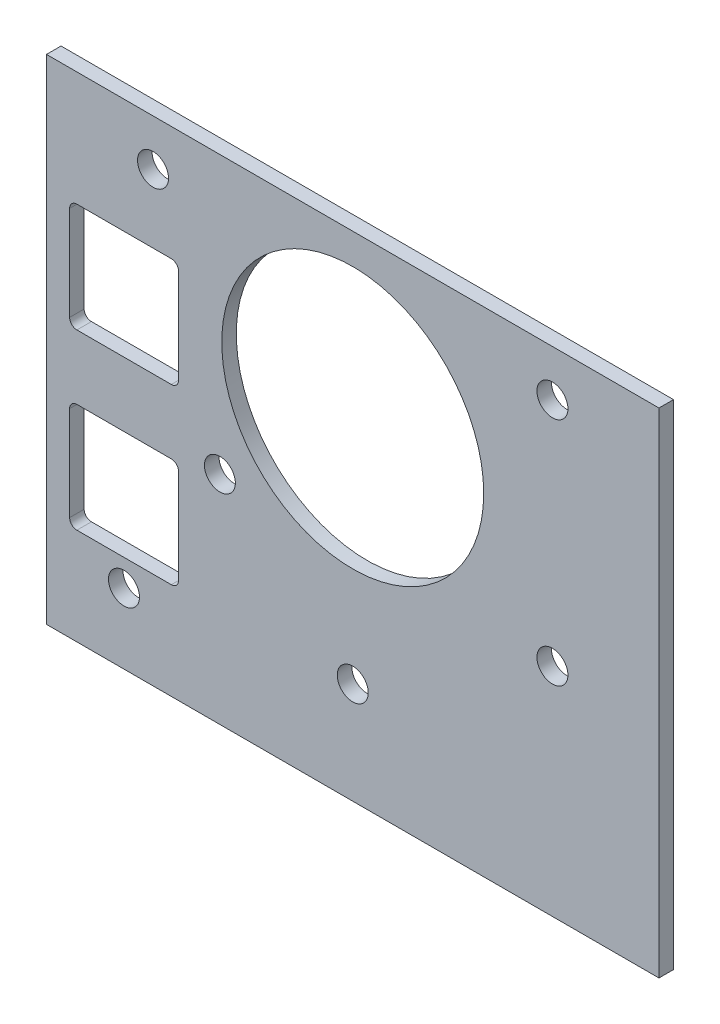
ISO-10303-21;
HEADER;
FILE_DESCRIPTION(('STEP AP214'),'2;1');
FILE_NAME('part.step','',(''),(''),'','','');
FILE_SCHEMA(('AUTOMOTIVE_DESIGN { 1 0 10303 214 1 1 1 1 }'));
ENDSEC;
DATA;
#1=APPLICATION_CONTEXT('core data for automotive mechanical design processes');
#2=APPLICATION_PROTOCOL_DEFINITION('international standard','automotive_design',2000,#1);
#3=PRODUCT_CONTEXT('',#1,'mechanical');
#4=PRODUCT('Part','Part','',(#3));
#5=PRODUCT_RELATED_PRODUCT_CATEGORY('part','',(#4));
#6=PRODUCT_DEFINITION_FORMATION('','',#4);
#7=PRODUCT_DEFINITION_CONTEXT('part definition',#1,'design');
#8=PRODUCT_DEFINITION('design','',#6,#7);
#9=PRODUCT_DEFINITION_SHAPE('','',#8);
#10=(LENGTH_UNIT() NAMED_UNIT(*) SI_UNIT(.MILLI.,.METRE.));
#11=(NAMED_UNIT(*) PLANE_ANGLE_UNIT() SI_UNIT($,.RADIAN.));
#12=(NAMED_UNIT(*) SI_UNIT($,.STERADIAN.) SOLID_ANGLE_UNIT());
#13=UNCERTAINTY_MEASURE_WITH_UNIT(LENGTH_MEASURE(1.E-05),#10,'distance_accuracy_value','');
#14=(GEOMETRIC_REPRESENTATION_CONTEXT(3) GLOBAL_UNCERTAINTY_ASSIGNED_CONTEXT((#13)) GLOBAL_UNIT_ASSIGNED_CONTEXT((#10,
#11,#12)) REPRESENTATION_CONTEXT('',''));
#15=CARTESIAN_POINT('',(0.,0.,0.));
#16=DIRECTION('',(0.,0.,1.));
#17=DIRECTION('',(1.,0.,0.));
#18=AXIS2_PLACEMENT_3D('',#15,#16,#17);
#19=CARTESIAN_POINT('',(-84.7844062504235,-130.046931250371,-0.0174188281249757));
#20=DIRECTION('',(1.,0.,0.));
#21=DIRECTION('',(0.,1.,0.));
#22=AXIS2_PLACEMENT_3D('',#19,#20,#21);
#23=PLANE('',#22);
#24=DIRECTION('',(0.,-1.,0.));
#25=VECTOR('',#24,1.);
#26=CARTESIAN_POINT('',(-84.7844062504235,-130.046931250371,-1.01741882812497));
#27=LINE('',#26,#25);
#28=CARTESIAN_POINT('',(-84.7844062504235,-130.046931250371,-1.01741882812497));
#29=VERTEX_POINT('',#28);
#30=CARTESIAN_POINT('',(-84.7844062504235,-164.032131250371,-1.01741882812497));
#31=VERTEX_POINT('',#30);
#32=EDGE_CURVE('E392',#29,#31,#27,.T.);
#33=ORIENTED_EDGE('',*,*,#32,.F.);
#34=DIRECTION('',(0.,0.,-1.));
#35=VECTOR('',#34,1.);
#36=CARTESIAN_POINT('',(-84.7844062504235,-130.046931250371,-0.0174188281249757));
#37=LINE('',#36,#35);
#38=CARTESIAN_POINT('',(-84.7844062504235,-130.046931250371,-0.0174188281249757));
#39=VERTEX_POINT('',#38);
#40=EDGE_CURVE('E11',#39,#29,#37,.T.);
#41=ORIENTED_EDGE('',*,*,#40,.F.);
#42=DIRECTION('',(0.,-1.,0.));
#43=VECTOR('',#42,1.);
#44=CARTESIAN_POINT('',(-84.7844062504235,-130.046931250371,-0.0174188281249757));
#45=LINE('',#44,#43);
#46=CARTESIAN_POINT('',(-84.7844062504235,-164.032131250371,-0.0174188281249757));
#47=VERTEX_POINT('',#46);
#48=EDGE_CURVE('E414',#39,#47,#45,.T.);
#49=ORIENTED_EDGE('',*,*,#48,.T.);
#50=DIRECTION('',(0.,0.,-1.));
#51=VECTOR('',#50,1.);
#52=CARTESIAN_POINT('',(-84.7844062504235,-164.032131250371,-0.0174188281249757));
#53=LINE('',#52,#51);
#54=EDGE_CURVE('E42',#47,#31,#53,.T.);
#55=ORIENTED_EDGE('',*,*,#54,.T.);
#56=EDGE_LOOP('',(#33,#41,#49,#55));
#57=FACE_BOUND('',#56,.T.);
#58=ADVANCED_FACE('F39',(#57),#23,.T.);
#59=CARTESIAN_POINT('',(-126.948406250423,-130.046931250371,-0.0174188281249757));
#60=DIRECTION('',(0.,1.,0.));
#61=DIRECTION('',(0.,0.,1.));
#62=AXIS2_PLACEMENT_3D('',#59,#60,#61);
#63=PLANE('',#62);
#64=DIRECTION('',(1.,0.,0.));
#65=VECTOR('',#64,1.);
#66=CARTESIAN_POINT('',(-126.948406250423,-130.046931250371,-1.01741882812497));
#67=LINE('',#66,#65);
#68=CARTESIAN_POINT('',(-126.948406250423,-130.046931250371,-1.01741882812497));
#69=VERTEX_POINT('',#68);
#70=EDGE_CURVE('E419',#69,#29,#67,.T.);
#71=ORIENTED_EDGE('',*,*,#70,.F.);
#72=DIRECTION('',(0.,0.,-1.));
#73=VECTOR('',#72,1.);
#74=CARTESIAN_POINT('',(-126.948406250423,-130.046931250371,-0.0174188281249757));
#75=LINE('',#74,#73);
#76=CARTESIAN_POINT('',(-126.948406250423,-130.046931250371,-0.0174188281249757));
#77=VERTEX_POINT('',#76);
#78=EDGE_CURVE('E48',#77,#69,#75,.T.);
#79=ORIENTED_EDGE('',*,*,#78,.F.);
#80=DIRECTION('',(1.,0.,0.));
#81=VECTOR('',#80,1.);
#82=CARTESIAN_POINT('',(-126.948406250423,-130.046931250371,-0.0174188281249757));
#83=LINE('',#82,#81);
#84=EDGE_CURVE('E427',#77,#39,#83,.T.);
#85=ORIENTED_EDGE('',*,*,#84,.T.);
#86=ORIENTED_EDGE('',*,*,#40,.T.);
#87=EDGE_LOOP('',(#71,#79,#85,#86));
#88=FACE_BOUND('',#87,.T.);
#89=ADVANCED_FACE('F461',(#88),#63,.T.);
#90=CARTESIAN_POINT('',(-126.948406250423,-130.046931250371,-0.0174188281249757));
#91=DIRECTION('',(-1.,0.,0.));
#92=DIRECTION('',(0.,0.,1.));
#93=AXIS2_PLACEMENT_3D('',#90,#91,#92);
#94=PLANE('',#93);
#95=DIRECTION('',(0.,1.,0.));
#96=VECTOR('',#95,1.);
#97=CARTESIAN_POINT('',(-126.948406250423,-130.046931250371,-1.01741882812497));
#98=LINE('',#97,#96);
#99=CARTESIAN_POINT('',(-126.948406250423,-164.032131250371,-1.01741882812497));
#100=VERTEX_POINT('',#99);
#101=EDGE_CURVE('E438',#100,#69,#98,.T.);
#102=ORIENTED_EDGE('',*,*,#101,.F.);
#103=DIRECTION('',(0.,0.,-1.));
#104=VECTOR('',#103,1.);
#105=CARTESIAN_POINT('',(-126.948406250423,-164.032131250371,-0.0174188281249757));
#106=LINE('',#105,#104);
#107=CARTESIAN_POINT('',(-126.948406250423,-164.032131250371,-0.0174188281249757));
#108=VERTEX_POINT('',#107);
#109=EDGE_CURVE('E446',#108,#100,#106,.T.);
#110=ORIENTED_EDGE('',*,*,#109,.F.);
#111=DIRECTION('',(0.,1.,0.));
#112=VECTOR('',#111,1.);
#113=CARTESIAN_POINT('',(-126.948406250423,-130.046931250371,-0.0174188281249757));
#114=LINE('',#113,#112);
#115=EDGE_CURVE('E423',#108,#77,#114,.T.);
#116=ORIENTED_EDGE('',*,*,#115,.T.);
#117=ORIENTED_EDGE('',*,*,#78,.T.);
#118=EDGE_LOOP('',(#102,#110,#116,#117));
#119=FACE_BOUND('',#118,.T.);
#120=ADVANCED_FACE('F466',(#119),#94,.T.);
#121=CARTESIAN_POINT('',(-126.948406250423,-164.032131250371,-0.0174188281249757));
#122=DIRECTION('',(0.,-1.,0.));
#123=DIRECTION('',(1.,0.,0.));
#124=AXIS2_PLACEMENT_3D('',#121,#122,#123);
#125=PLANE('',#124);
#126=DIRECTION('',(-1.,0.,0.));
#127=VECTOR('',#126,1.);
#128=CARTESIAN_POINT('',(-126.948406250423,-164.032131250371,-1.01741882812497));
#129=LINE('',#128,#127);
#130=EDGE_CURVE('E434',#31,#100,#129,.T.);
#131=ORIENTED_EDGE('',*,*,#130,.F.);
#132=ORIENTED_EDGE('',*,*,#54,.F.);
#133=DIRECTION('',(-1.,0.,0.));
#134=VECTOR('',#133,1.);
#135=CARTESIAN_POINT('',(-126.948406250423,-164.032131250371,-0.0174188281249757));
#136=LINE('',#135,#134);
#137=EDGE_CURVE('E418',#47,#108,#136,.T.);
#138=ORIENTED_EDGE('',*,*,#137,.T.);
#139=ORIENTED_EDGE('',*,*,#109,.T.);
#140=EDGE_LOOP('',(#131,#132,#138,#139));
#141=FACE_BOUND('',#140,.T.);
#142=ADVANCED_FACE('F456',(#141),#125,.T.);
#143=CARTESIAN_POINT('',(0.,0.,-0.0174188281249757));
#144=DIRECTION('',(0.,0.,1.));
#145=DIRECTION('',(1.,0.,0.));
#146=AXIS2_PLACEMENT_3D('',#143,#144,#145);
#147=PLANE('',#146);
#148=CARTESIAN_POINT('',(-124.8565459784,-156.868131250372,-0.0174188281249757));
#149=DIRECTION('',(0.,0.,-1.));
#150=DIRECTION('',(1.,0.,0.));
#151=AXIS2_PLACEMENT_3D('',#148,#149,#150);
#152=CIRCLE('',#151,0.499999999999966);
#153=CARTESIAN_POINT('',(-124.8565459784,-157.368131250372,-0.0174188281249757));
#154=VERTEX_POINT('',#153);
#155=CARTESIAN_POINT('',(-125.3565459784,-156.868131250372,-0.0174188281249757));
#156=VERTEX_POINT('',#155);
#157=EDGE_CURVE('E179',#154,#156,#152,.T.);
#158=ORIENTED_EDGE('',*,*,#157,.T.);
#159=DIRECTION('',(0.,1.,0.));
#160=VECTOR('',#159,1.);
#161=CARTESIAN_POINT('',(-125.3565459784,-150.368131250372,-0.0174188281249757));
#162=LINE('',#161,#160);
#163=CARTESIAN_POINT('',(-125.3565459784,-150.368131250372,-0.0174188281249757));
#164=VERTEX_POINT('',#163);
#165=EDGE_CURVE('E189',#156,#164,#162,.T.);
#166=ORIENTED_EDGE('',*,*,#165,.T.);
#167=CARTESIAN_POINT('',(-124.8565459784,-150.368131250372,-0.0174188281249757));
#168=DIRECTION('',(0.,0.,-1.));
#169=DIRECTION('',(1.,0.,0.));
#170=AXIS2_PLACEMENT_3D('',#167,#168,#169);
#171=CIRCLE('',#170,0.499999999999966);
#172=CARTESIAN_POINT('',(-124.8565459784,-149.868131250372,-0.0174188281249757));
#173=VERTEX_POINT('',#172);
#174=EDGE_CURVE('E56',#164,#173,#171,.T.);
#175=ORIENTED_EDGE('',*,*,#174,.T.);
#176=DIRECTION('',(1.,0.,0.));
#177=VECTOR('',#176,1.);
#178=CARTESIAN_POINT('',(-118.3565459784,-149.868131250372,-0.0174188281249757));
#179=LINE('',#178,#177);
#180=CARTESIAN_POINT('',(-118.3565459784,-149.868131250372,-0.0174188281249757));
#181=VERTEX_POINT('',#180);
#182=EDGE_CURVE('E208',#173,#181,#179,.T.);
#183=ORIENTED_EDGE('',*,*,#182,.T.);
#184=CARTESIAN_POINT('',(-118.3565459784,-150.368131250373,-0.0174188281249757));
#185=DIRECTION('',(0.,0.,-1.));
#186=DIRECTION('',(1.,0.,0.));
#187=AXIS2_PLACEMENT_3D('',#184,#185,#186);
#188=CIRCLE('',#187,0.50000000000007);
#189=CARTESIAN_POINT('',(-117.8565459784,-150.368131250373,-0.0174188281249757));
#190=VERTEX_POINT('',#189);
#191=EDGE_CURVE('E212',#181,#190,#188,.T.);
#192=ORIENTED_EDGE('',*,*,#191,.T.);
#193=DIRECTION('',(0.,-1.,0.));
#194=VECTOR('',#193,1.);
#195=CARTESIAN_POINT('',(-117.8565459784,-156.868131250372,-0.0174188281249757));
#196=LINE('',#195,#194);
#197=CARTESIAN_POINT('',(-117.8565459784,-156.868131250372,-0.0174188281249757));
#198=VERTEX_POINT('',#197);
#199=EDGE_CURVE('E216',#190,#198,#196,.T.);
#200=ORIENTED_EDGE('',*,*,#199,.T.);
#201=CARTESIAN_POINT('',(-118.3565459784,-156.868131250372,-0.0174188281249757));
#202=DIRECTION('',(0.,0.,-1.));
#203=DIRECTION('',(1.,0.,0.));
#204=AXIS2_PLACEMENT_3D('',#201,#202,#203);
#205=CIRCLE('',#204,0.50000000000007);
#206=CARTESIAN_POINT('',(-118.3565459784,-157.368131250372,-0.0174188281249757));
#207=VERTEX_POINT('',#206);
#208=EDGE_CURVE('E220',#198,#207,#205,.T.);
#209=ORIENTED_EDGE('',*,*,#208,.T.);
#210=DIRECTION('',(-1.,0.,0.));
#211=VECTOR('',#210,1.);
#212=CARTESIAN_POINT('',(-124.8565459784,-157.368131250372,-0.0174188281249757));
#213=LINE('',#212,#211);
#214=EDGE_CURVE('E186',#207,#154,#213,.T.);
#215=ORIENTED_EDGE('',*,*,#214,.T.);
#216=EDGE_LOOP('',(#158,#166,#175,#183,#192,#200,#209,#215));
#217=FACE_BOUND('',#216,.T.);
#218=CARTESIAN_POINT('',(-121.614405678934,-159.202956250439,-0.0174188281249757));
#219=DIRECTION('',(0.,0.,-1.));
#220=DIRECTION('',(1.,0.,0.));
#221=AXIS2_PLACEMENT_3D('',#218,#219,#220);
#222=CIRCLE('',#221,1.06680000000001);
#223=CARTESIAN_POINT('',(-120.547605678934,-159.202956250439,-0.0174188281249757));
#224=VERTEX_POINT('',#223);
#225=EDGE_CURVE('E270',#224,#224,#222,.T.);
#226=ORIENTED_EDGE('',*,*,#225,.T.);
#227=EDGE_LOOP('',(#226));
#228=FACE_BOUND('',#227,.T.);
#229=CARTESIAN_POINT('',(-115.010406250423,-149.106456250439,-0.0174188281249757));
#230=DIRECTION('',(0.,0.,-1.));
#231=DIRECTION('',(1.,0.,0.));
#232=AXIS2_PLACEMENT_3D('',#229,#230,#231);
#233=CIRCLE('',#232,1.06333511537501);
#234=CARTESIAN_POINT('',(-113.947071135048,-149.106456250439,-0.0174188281249757));
#235=VERTEX_POINT('',#234);
#236=EDGE_CURVE('E278',#235,#235,#233,.T.);
#237=ORIENTED_EDGE('',*,*,#236,.T.);
#238=EDGE_LOOP('',(#237));
#239=FACE_BOUND('',#238,.T.);
#240=CARTESIAN_POINT('',(-105.866406250423,-157.043956250439,-0.0174188281249757));
#241=DIRECTION('',(0.,0.,-1.));
#242=DIRECTION('',(1.,0.,0.));
#243=AXIS2_PLACEMENT_3D('',#240,#241,#242);
#244=CIRCLE('',#243,1.06680000000001);
#245=CARTESIAN_POINT('',(-104.799606250423,-157.043956250439,-0.0174188281249757));
#246=VERTEX_POINT('',#245);
#247=EDGE_CURVE('E286',#246,#246,#244,.T.);
#248=ORIENTED_EDGE('',*,*,#247,.T.);
#249=EDGE_LOOP('',(#248));
#250=FACE_BOUND('',#249,.T.);
#251=CARTESIAN_POINT('',(-119.614559535501,-133.231456250439,-0.0174188281249757));
#252=DIRECTION('',(0.,0.,-1.));
#253=DIRECTION('',(1.,0.,0.));
#254=AXIS2_PLACEMENT_3D('',#251,#252,#253);
#255=CIRCLE('',#254,1.06680000000001);
#256=CARTESIAN_POINT('',(-118.547759535501,-133.231456250439,-0.0174188281249757));
#257=VERTEX_POINT('',#256);
#258=EDGE_CURVE('E294',#257,#257,#255,.T.);
#259=ORIENTED_EDGE('',*,*,#258,.T.);
#260=EDGE_LOOP('',(#259));
#261=FACE_BOUND('',#260,.T.);
#262=CARTESIAN_POINT('',(-92.1182529653455,-133.231456250439,-0.0174188281249757));
#263=DIRECTION('',(0.,0.,-1.));
#264=DIRECTION('',(1.,0.,0.));
#265=AXIS2_PLACEMENT_3D('',#262,#263,#264);
#266=CIRCLE('',#265,1.06680000000001);
#267=CARTESIAN_POINT('',(-91.0514529653455,-133.231456250439,-0.0174188281249757));
#268=VERTEX_POINT('',#267);
#269=EDGE_CURVE('E302',#268,#268,#266,.T.);
#270=ORIENTED_EDGE('',*,*,#269,.T.);
#271=EDGE_LOOP('',(#270));
#272=FACE_BOUND('',#271,.T.);
#273=CARTESIAN_POINT('',(-92.1182529653455,-149.106456250439,-0.0174188281249757));
#274=DIRECTION('',(0.,0.,-1.));
#275=DIRECTION('',(1.,0.,0.));
#276=AXIS2_PLACEMENT_3D('',#273,#274,#275);
#277=CIRCLE('',#276,1.06680000000001);
#278=CARTESIAN_POINT('',(-91.0514529653455,-149.106456250439,-0.0174188281249757));
#279=VERTEX_POINT('',#278);
#280=EDGE_CURVE('E310',#279,#279,#277,.T.);
#281=ORIENTED_EDGE('',*,*,#280,.T.);
#282=EDGE_LOOP('',(#281));
#283=FACE_BOUND('',#282,.T.);
#284=CARTESIAN_POINT('',(-105.866406250423,-141.168956250439,-0.0174188281249757));
#285=DIRECTION('',(0.,0.,-1.));
#286=DIRECTION('',(1.,0.,0.));
#287=AXIS2_PLACEMENT_3D('',#284,#285,#286);
#288=CIRCLE('',#287,9.01699999999999);
#289=CARTESIAN_POINT('',(-96.8494062504234,-141.168956250439,-0.0174188281249757));
#290=VERTEX_POINT('',#289);
#291=EDGE_CURVE('E318',#290,#290,#288,.T.);
#292=ORIENTED_EDGE('',*,*,#291,.T.);
#293=EDGE_LOOP('',(#292));
#294=FACE_BOUND('',#293,.T.);
#295=CARTESIAN_POINT('',(-118.3565459784,-138.430131250371,-0.0174188281249757));
#296=DIRECTION('',(0.,0.,-1.));
#297=DIRECTION('',(1.,0.,0.));
#298=AXIS2_PLACEMENT_3D('',#295,#296,#297);
#299=CIRCLE('',#298,0.5);
#300=CARTESIAN_POINT('',(-118.3565459784,-137.930131250371,-0.0174188281249757));
#301=VERTEX_POINT('',#300);
#302=CARTESIAN_POINT('',(-117.8565459784,-138.430131250371,-0.0174188281249757));
#303=VERTEX_POINT('',#302);
#304=EDGE_CURVE('E326',#301,#303,#299,.T.);
#305=ORIENTED_EDGE('',*,*,#304,.T.);
#306=DIRECTION('',(0.,-1.,0.));
#307=VECTOR('',#306,1.);
#308=CARTESIAN_POINT('',(-117.8565459784,-144.930131250371,-0.0174188281249757));
#309=LINE('',#308,#307);
#310=CARTESIAN_POINT('',(-117.8565459784,-144.930131250371,-0.0174188281249757));
#311=VERTEX_POINT('',#310);
#312=EDGE_CURVE('E330',#303,#311,#309,.T.);
#313=ORIENTED_EDGE('',*,*,#312,.T.);
#314=CARTESIAN_POINT('',(-118.3565459784,-144.930131250371,-0.0174188281249757));
#315=DIRECTION('',(0.,0.,-1.));
#316=DIRECTION('',(1.,0.,0.));
#317=AXIS2_PLACEMENT_3D('',#314,#315,#316);
#318=CIRCLE('',#317,0.5);
#319=CARTESIAN_POINT('',(-118.3565459784,-145.430131250371,-0.0174188281249757));
#320=VERTEX_POINT('',#319);
#321=EDGE_CURVE('E335',#311,#320,#318,.T.);
#322=ORIENTED_EDGE('',*,*,#321,.T.);
#323=DIRECTION('',(-1.,0.,0.));
#324=VECTOR('',#323,1.);
#325=CARTESIAN_POINT('',(-124.8565459784,-145.430131250371,-0.0174188281249757));
#326=LINE('',#325,#324);
#327=CARTESIAN_POINT('',(-124.8565459784,-145.430131250371,-0.0174188281249757));
#328=VERTEX_POINT('',#327);
#329=EDGE_CURVE('E339',#320,#328,#326,.T.);
#330=ORIENTED_EDGE('',*,*,#329,.T.);
#331=CARTESIAN_POINT('',(-124.8565459784,-144.930131250371,-0.0174188281249757));
#332=DIRECTION('',(0.,0.,-1.));
#333=DIRECTION('',(1.,0.,0.));
#334=AXIS2_PLACEMENT_3D('',#331,#332,#333);
#335=CIRCLE('',#334,0.499999999999994);
#336=CARTESIAN_POINT('',(-125.3565459784,-144.930131250371,-0.0174188281249757));
#337=VERTEX_POINT('',#336);
#338=EDGE_CURVE('E343',#328,#337,#335,.T.);
#339=ORIENTED_EDGE('',*,*,#338,.T.);
#340=DIRECTION('',(0.,1.,0.));
#341=VECTOR('',#340,1.);
#342=CARTESIAN_POINT('',(-125.3565459784,-138.430131250371,-0.0174188281249757));
#343=LINE('',#342,#341);
#344=CARTESIAN_POINT('',(-125.3565459784,-138.430131250371,-0.0174188281249757));
#345=VERTEX_POINT('',#344);
#346=EDGE_CURVE('E347',#337,#345,#343,.T.);
#347=ORIENTED_EDGE('',*,*,#346,.T.);
#348=CARTESIAN_POINT('',(-124.8565459784,-138.430131250371,-0.0174188281249757));
#349=DIRECTION('',(0.,0.,-1.));
#350=DIRECTION('',(1.,0.,0.));
#351=AXIS2_PLACEMENT_3D('',#348,#349,#350);
#352=CIRCLE('',#351,0.5);
#353=CARTESIAN_POINT('',(-124.8565459784,-137.930131250371,-0.0174188281249757));
#354=VERTEX_POINT('',#353);
#355=EDGE_CURVE('E351',#345,#354,#352,.T.);
#356=ORIENTED_EDGE('',*,*,#355,.T.);
#357=DIRECTION('',(1.,0.,0.));
#358=VECTOR('',#357,1.);
#359=CARTESIAN_POINT('',(-118.3565459784,-137.930131250371,-0.0174188281249757));
#360=LINE('',#359,#358);
#361=EDGE_CURVE('E355',#354,#301,#360,.T.);
#362=ORIENTED_EDGE('',*,*,#361,.T.);
#363=EDGE_LOOP('',(#305,#313,#322,#330,#339,#347,#356,#362));
#364=FACE_BOUND('',#363,.T.);
#365=ORIENTED_EDGE('',*,*,#48,.F.);
#366=ORIENTED_EDGE('',*,*,#84,.F.);
#367=ORIENTED_EDGE('',*,*,#115,.F.);
#368=ORIENTED_EDGE('',*,*,#137,.F.);
#369=EDGE_LOOP('',(#365,#366,#367,#368));
#370=FACE_BOUND('',#369,.T.);
#371=ADVANCED_FACE('F194',(#217,#228,#239,#250,#261,#272,#283,#294,#364,#370),#147,.T.);
#372=CARTESIAN_POINT('',(0.,0.,-1.01741882812497));
#373=DIRECTION('',(0.,0.,1.));
#374=DIRECTION('',(1.,0.,0.));
#375=AXIS2_PLACEMENT_3D('',#372,#373,#374);
#376=PLANE('',#375);
#377=DIRECTION('',(0.,1.,0.));
#378=VECTOR('',#377,1.);
#379=CARTESIAN_POINT('',(-125.3565459784,-150.368131250372,-1.01741882812497));
#380=LINE('',#379,#378);
#381=CARTESIAN_POINT('',(-125.3565459784,-156.868131250372,-1.01741882812497));
#382=VERTEX_POINT('',#381);
#383=CARTESIAN_POINT('',(-125.3565459784,-150.368131250372,-1.01741882812497));
#384=VERTEX_POINT('',#383);
#385=EDGE_CURVE('E227',#382,#384,#380,.T.);
#386=ORIENTED_EDGE('',*,*,#385,.F.);
#387=CARTESIAN_POINT('',(-124.8565459784,-156.868131250372,-1.01741882812497));
#388=DIRECTION('',(0.,0.,-1.));
#389=DIRECTION('',(1.,0.,0.));
#390=AXIS2_PLACEMENT_3D('',#387,#388,#389);
#391=CIRCLE('',#390,0.499999999999966);
#392=CARTESIAN_POINT('',(-124.8565459784,-157.368131250372,-1.01741882812497));
#393=VERTEX_POINT('',#392);
#394=EDGE_CURVE('E64',#393,#382,#391,.T.);
#395=ORIENTED_EDGE('',*,*,#394,.F.);
#396=DIRECTION('',(-1.,0.,0.));
#397=VECTOR('',#396,1.);
#398=CARTESIAN_POINT('',(-124.8565459784,-157.368131250372,-1.01741882812497));
#399=LINE('',#398,#397);
#400=CARTESIAN_POINT('',(-118.3565459784,-157.368131250372,-1.01741882812497));
#401=VERTEX_POINT('',#400);
#402=EDGE_CURVE('E199',#401,#393,#399,.T.);
#403=ORIENTED_EDGE('',*,*,#402,.F.);
#404=CARTESIAN_POINT('',(-118.3565459784,-156.868131250372,-1.01741882812497));
#405=DIRECTION('',(0.,0.,-1.));
#406=DIRECTION('',(1.,0.,0.));
#407=AXIS2_PLACEMENT_3D('',#404,#405,#406);
#408=CIRCLE('',#407,0.50000000000007);
#409=CARTESIAN_POINT('',(-117.8565459784,-156.868131250372,-1.01741882812497));
#410=VERTEX_POINT('',#409);
#411=EDGE_CURVE('E203',#410,#401,#408,.T.);
#412=ORIENTED_EDGE('',*,*,#411,.F.);
#413=DIRECTION('',(0.,-1.,0.));
#414=VECTOR('',#413,1.);
#415=CARTESIAN_POINT('',(-117.8565459784,-156.868131250372,-1.01741882812497));
#416=LINE('',#415,#414);
#417=CARTESIAN_POINT('',(-117.8565459784,-150.368131250373,-1.01741882812497));
#418=VERTEX_POINT('',#417);
#419=EDGE_CURVE('E242',#418,#410,#416,.T.);
#420=ORIENTED_EDGE('',*,*,#419,.F.);
#421=CARTESIAN_POINT('',(-118.3565459784,-150.368131250373,-1.01741882812497));
#422=DIRECTION('',(0.,0.,-1.));
#423=DIRECTION('',(1.,0.,0.));
#424=AXIS2_PLACEMENT_3D('',#421,#422,#423);
#425=CIRCLE('',#424,0.50000000000007);
#426=CARTESIAN_POINT('',(-118.3565459784,-149.868131250372,-1.01741882812497));
#427=VERTEX_POINT('',#426);
#428=EDGE_CURVE('E238',#427,#418,#425,.T.);
#429=ORIENTED_EDGE('',*,*,#428,.F.);
#430=DIRECTION('',(1.,0.,0.));
#431=VECTOR('',#430,1.);
#432=CARTESIAN_POINT('',(-118.3565459784,-149.868131250372,-1.01741882812497));
#433=LINE('',#432,#431);
#434=CARTESIAN_POINT('',(-124.8565459784,-149.868131250372,-1.01741882812497));
#435=VERTEX_POINT('',#434);
#436=EDGE_CURVE('E234',#435,#427,#433,.T.);
#437=ORIENTED_EDGE('',*,*,#436,.F.);
#438=CARTESIAN_POINT('',(-124.8565459784,-150.368131250372,-1.01741882812497));
#439=DIRECTION('',(0.,0.,-1.));
#440=DIRECTION('',(1.,0.,0.));
#441=AXIS2_PLACEMENT_3D('',#438,#439,#440);
#442=CIRCLE('',#441,0.499999999999966);
#443=EDGE_CURVE('E230',#384,#435,#442,.T.);
#444=ORIENTED_EDGE('',*,*,#443,.F.);
#445=EDGE_LOOP('',(#386,#395,#403,#412,#420,#429,#437,#444));
#446=FACE_BOUND('',#445,.T.);
#447=CARTESIAN_POINT('',(-121.614405678934,-159.202956250439,-1.01741882812497));
#448=DIRECTION('',(0.,0.,-1.));
#449=DIRECTION('',(1.,0.,0.));
#450=AXIS2_PLACEMENT_3D('',#447,#448,#449);
#451=CIRCLE('',#450,1.06680000000001);
#452=CARTESIAN_POINT('',(-120.547605678934,-159.202956250439,-1.01741882812497));
#453=VERTEX_POINT('',#452);
#454=EDGE_CURVE('E252',#453,#453,#451,.T.);
#455=ORIENTED_EDGE('',*,*,#454,.F.);
#456=EDGE_LOOP('',(#455));
#457=FACE_BOUND('',#456,.T.);
#458=CARTESIAN_POINT('',(-115.010406250423,-149.106456250439,-1.01741882812497));
#459=DIRECTION('',(0.,0.,-1.));
#460=DIRECTION('',(1.,0.,0.));
#461=AXIS2_PLACEMENT_3D('',#458,#459,#460);
#462=CIRCLE('',#461,1.06333511537501);
#463=CARTESIAN_POINT('',(-113.947071135048,-149.106456250439,-1.01741882812497));
#464=VERTEX_POINT('',#463);
#465=EDGE_CURVE('E274',#464,#464,#462,.T.);
#466=ORIENTED_EDGE('',*,*,#465,.F.);
#467=EDGE_LOOP('',(#466));
#468=FACE_BOUND('',#467,.T.);
#469=CARTESIAN_POINT('',(-105.866406250423,-157.043956250439,-1.01741882812497));
#470=DIRECTION('',(0.,0.,-1.));
#471=DIRECTION('',(1.,0.,0.));
#472=AXIS2_PLACEMENT_3D('',#469,#470,#471);
#473=CIRCLE('',#472,1.06680000000001);
#474=CARTESIAN_POINT('',(-104.799606250423,-157.043956250439,-1.01741882812497));
#475=VERTEX_POINT('',#474);
#476=EDGE_CURVE('E282',#475,#475,#473,.T.);
#477=ORIENTED_EDGE('',*,*,#476,.F.);
#478=EDGE_LOOP('',(#477));
#479=FACE_BOUND('',#478,.T.);
#480=CARTESIAN_POINT('',(-119.614559535501,-133.231456250439,-1.01741882812497));
#481=DIRECTION('',(0.,0.,-1.));
#482=DIRECTION('',(1.,0.,0.));
#483=AXIS2_PLACEMENT_3D('',#480,#481,#482);
#484=CIRCLE('',#483,1.06680000000001);
#485=CARTESIAN_POINT('',(-118.547759535501,-133.231456250439,-1.01741882812497));
#486=VERTEX_POINT('',#485);
#487=EDGE_CURVE('E290',#486,#486,#484,.T.);
#488=ORIENTED_EDGE('',*,*,#487,.F.);
#489=EDGE_LOOP('',(#488));
#490=FACE_BOUND('',#489,.T.);
#491=CARTESIAN_POINT('',(-92.1182529653455,-133.231456250439,-1.01741882812497));
#492=DIRECTION('',(0.,0.,-1.));
#493=DIRECTION('',(1.,0.,0.));
#494=AXIS2_PLACEMENT_3D('',#491,#492,#493);
#495=CIRCLE('',#494,1.06680000000001);
#496=CARTESIAN_POINT('',(-91.0514529653455,-133.231456250439,-1.01741882812497));
#497=VERTEX_POINT('',#496);
#498=EDGE_CURVE('E298',#497,#497,#495,.T.);
#499=ORIENTED_EDGE('',*,*,#498,.F.);
#500=EDGE_LOOP('',(#499));
#501=FACE_BOUND('',#500,.T.);
#502=CARTESIAN_POINT('',(-92.1182529653455,-149.106456250439,-1.01741882812497));
#503=DIRECTION('',(0.,0.,-1.));
#504=DIRECTION('',(1.,0.,0.));
#505=AXIS2_PLACEMENT_3D('',#502,#503,#504);
#506=CIRCLE('',#505,1.06680000000001);
#507=CARTESIAN_POINT('',(-91.0514529653455,-149.106456250439,-1.01741882812497));
#508=VERTEX_POINT('',#507);
#509=EDGE_CURVE('E306',#508,#508,#506,.T.);
#510=ORIENTED_EDGE('',*,*,#509,.F.);
#511=EDGE_LOOP('',(#510));
#512=FACE_BOUND('',#511,.T.);
#513=CARTESIAN_POINT('',(-105.866406250423,-141.168956250439,-1.01741882812497));
#514=DIRECTION('',(0.,0.,-1.));
#515=DIRECTION('',(1.,0.,0.));
#516=AXIS2_PLACEMENT_3D('',#513,#514,#515);
#517=CIRCLE('',#516,9.01699999999999);
#518=CARTESIAN_POINT('',(-96.8494062504234,-141.168956250439,-1.01741882812497));
#519=VERTEX_POINT('',#518);
#520=EDGE_CURVE('E314',#519,#519,#517,.T.);
#521=ORIENTED_EDGE('',*,*,#520,.F.);
#522=EDGE_LOOP('',(#521));
#523=FACE_BOUND('',#522,.T.);
#524=DIRECTION('',(0.,-1.,0.));
#525=VECTOR('',#524,1.);
#526=CARTESIAN_POINT('',(-117.8565459784,-144.930131250371,-1.01741882812497));
#527=LINE('',#526,#525);
#528=CARTESIAN_POINT('',(-117.8565459784,-138.430131250371,-1.01741882812497));
#529=VERTEX_POINT('',#528);
#530=CARTESIAN_POINT('',(-117.8565459784,-144.930131250371,-1.01741882812497));
#531=VERTEX_POINT('',#530);
#532=EDGE_CURVE('E362',#529,#531,#527,.T.);
#533=ORIENTED_EDGE('',*,*,#532,.F.);
#534=CARTESIAN_POINT('',(-118.3565459784,-138.430131250371,-1.01741882812497));
#535=DIRECTION('',(0.,0.,-1.));
#536=DIRECTION('',(1.,0.,0.));
#537=AXIS2_PLACEMENT_3D('',#534,#535,#536);
#538=CIRCLE('',#537,0.5);
#539=CARTESIAN_POINT('',(-118.3565459784,-137.930131250371,-1.01741882812497));
#540=VERTEX_POINT('',#539);
#541=EDGE_CURVE('E322',#540,#529,#538,.T.);
#542=ORIENTED_EDGE('',*,*,#541,.F.);
#543=DIRECTION('',(1.,0.,0.));
#544=VECTOR('',#543,1.);
#545=CARTESIAN_POINT('',(-118.3565459784,-137.930131250371,-1.01741882812497));
#546=LINE('',#545,#544);
#547=CARTESIAN_POINT('',(-124.8565459784,-137.930131250371,-1.01741882812497));
#548=VERTEX_POINT('',#547);
#549=EDGE_CURVE('E331',#548,#540,#546,.T.);
#550=ORIENTED_EDGE('',*,*,#549,.F.);
#551=CARTESIAN_POINT('',(-124.8565459784,-138.430131250371,-1.01741882812497));
#552=DIRECTION('',(0.,0.,-1.));
#553=DIRECTION('',(1.,0.,0.));
#554=AXIS2_PLACEMENT_3D('',#551,#552,#553);
#555=CIRCLE('',#554,0.5);
#556=CARTESIAN_POINT('',(-125.3565459784,-138.430131250371,-1.01741882812497));
#557=VERTEX_POINT('',#556);
#558=EDGE_CURVE('E382',#557,#548,#555,.T.);
#559=ORIENTED_EDGE('',*,*,#558,.F.);
#560=DIRECTION('',(0.,1.,0.));
#561=VECTOR('',#560,1.);
#562=CARTESIAN_POINT('',(-125.3565459784,-138.430131250371,-1.01741882812497));
#563=LINE('',#562,#561);
#564=CARTESIAN_POINT('',(-125.3565459784,-144.930131250371,-1.01741882812497));
#565=VERTEX_POINT('',#564);
#566=EDGE_CURVE('E378',#565,#557,#563,.T.);
#567=ORIENTED_EDGE('',*,*,#566,.F.);
#568=CARTESIAN_POINT('',(-124.8565459784,-144.930131250371,-1.01741882812497));
#569=DIRECTION('',(0.,0.,-1.));
#570=DIRECTION('',(1.,0.,0.));
#571=AXIS2_PLACEMENT_3D('',#568,#569,#570);
#572=CIRCLE('',#571,0.499999999999994);
#573=CARTESIAN_POINT('',(-124.8565459784,-145.430131250371,-1.01741882812497));
#574=VERTEX_POINT('',#573);
#575=EDGE_CURVE('E374',#574,#565,#572,.T.);
#576=ORIENTED_EDGE('',*,*,#575,.F.);
#577=DIRECTION('',(-1.,0.,0.));
#578=VECTOR('',#577,1.);
#579=CARTESIAN_POINT('',(-124.8565459784,-145.430131250371,-1.01741882812497));
#580=LINE('',#579,#578);
#581=CARTESIAN_POINT('',(-118.3565459784,-145.430131250371,-1.01741882812497));
#582=VERTEX_POINT('',#581);
#583=EDGE_CURVE('E370',#582,#574,#580,.T.);
#584=ORIENTED_EDGE('',*,*,#583,.F.);
#585=CARTESIAN_POINT('',(-118.3565459784,-144.930131250371,-1.01741882812497));
#586=DIRECTION('',(0.,0.,-1.));
#587=DIRECTION('',(1.,0.,0.));
#588=AXIS2_PLACEMENT_3D('',#585,#586,#587);
#589=CIRCLE('',#588,0.5);
#590=EDGE_CURVE('E366',#531,#582,#589,.T.);
#591=ORIENTED_EDGE('',*,*,#590,.F.);
#592=EDGE_LOOP('',(#533,#542,#550,#559,#567,#576,#584,#591));
#593=FACE_BOUND('',#592,.T.);
#594=ORIENTED_EDGE('',*,*,#32,.T.);
#595=ORIENTED_EDGE('',*,*,#130,.T.);
#596=ORIENTED_EDGE('',*,*,#101,.T.);
#597=ORIENTED_EDGE('',*,*,#70,.T.);
#598=EDGE_LOOP('',(#594,#595,#596,#597));
#599=FACE_BOUND('',#598,.T.);
#600=ADVANCED_FACE('F458',(#446,#457,#468,#479,#490,#501,#512,#523,#593,#599),#376,.F.);
#601=CARTESIAN_POINT('',(-118.3565459784,-138.430131250371,-0.0174188281249757));
#602=DIRECTION('',(0.,0.,-1.));
#603=DIRECTION('',(-1.,0.,0.));
#604=AXIS2_PLACEMENT_3D('',#601,#602,#603);
#605=CYLINDRICAL_SURFACE('',#604,0.5);
#606=ORIENTED_EDGE('',*,*,#541,.T.);
#607=DIRECTION('',(0.,0.,-1.));
#608=VECTOR('',#607,1.);
#609=CARTESIAN_POINT('',(-117.8565459784,-138.430131250371,-0.0174188281249757));
#610=LINE('',#609,#608);
#611=EDGE_CURVE('E359',#303,#529,#610,.T.);
#612=ORIENTED_EDGE('',*,*,#611,.F.);
#613=ORIENTED_EDGE('',*,*,#304,.F.);
#614=DIRECTION('',(0.,0.,-1.));
#615=VECTOR('',#614,1.);
#616=CARTESIAN_POINT('',(-118.3565459784,-137.930131250371,-0.0174188281249757));
#617=LINE('',#616,#615);
#618=EDGE_CURVE('E389',#301,#540,#617,.T.);
#619=ORIENTED_EDGE('',*,*,#618,.T.);
#620=EDGE_LOOP('',(#606,#612,#613,#619));
#621=FACE_BOUND('',#620,.T.);
#622=ADVANCED_FACE('F508',(#621),#605,.F.);
#623=CARTESIAN_POINT('',(-118.3565459784,-137.930131250371,-0.0174188281249757));
#624=DIRECTION('',(0.,1.,0.));
#625=DIRECTION('',(0.,0.,1.));
#626=AXIS2_PLACEMENT_3D('',#623,#624,#625);
#627=PLANE('',#626);
#628=ORIENTED_EDGE('',*,*,#549,.T.);
#629=ORIENTED_EDGE('',*,*,#618,.F.);
#630=ORIENTED_EDGE('',*,*,#361,.F.);
#631=DIRECTION('',(0.,0.,-1.));
#632=VECTOR('',#631,1.);
#633=CARTESIAN_POINT('',(-124.8565459784,-137.930131250371,-0.0174188281249757));
#634=LINE('',#633,#632);
#635=EDGE_CURVE('E393',#354,#548,#634,.T.);
#636=ORIENTED_EDGE('',*,*,#635,.T.);
#637=EDGE_LOOP('',(#628,#629,#630,#636));
#638=FACE_BOUND('',#637,.T.);
#639=ADVANCED_FACE('F518',(#638),#627,.F.);
#640=CARTESIAN_POINT('',(-124.8565459784,-138.430131250371,-0.0174188281249757));
#641=DIRECTION('',(0.,0.,-1.));
#642=DIRECTION('',(-1.,0.,0.));
#643=AXIS2_PLACEMENT_3D('',#640,#641,#642);
#644=CYLINDRICAL_SURFACE('',#643,0.5);
#645=ORIENTED_EDGE('',*,*,#558,.T.);
#646=ORIENTED_EDGE('',*,*,#635,.F.);
#647=ORIENTED_EDGE('',*,*,#355,.F.);
#648=DIRECTION('',(0.,0.,-1.));
#649=VECTOR('',#648,1.);
#650=CARTESIAN_POINT('',(-125.3565459784,-138.430131250371,-0.0174188281249757));
#651=LINE('',#650,#649);
#652=EDGE_CURVE('E396',#345,#557,#651,.T.);
#653=ORIENTED_EDGE('',*,*,#652,.T.);
#654=EDGE_LOOP('',(#645,#646,#647,#653));
#655=FACE_BOUND('',#654,.T.);
#656=ADVANCED_FACE('F528',(#655),#644,.F.);
#657=CARTESIAN_POINT('',(-125.3565459784,-138.430131250371,-0.0174188281249757));
#658=DIRECTION('',(-1.,0.,0.));
#659=DIRECTION('',(0.,0.,1.));
#660=AXIS2_PLACEMENT_3D('',#657,#658,#659);
#661=PLANE('',#660);
#662=ORIENTED_EDGE('',*,*,#566,.T.);
#663=ORIENTED_EDGE('',*,*,#652,.F.);
#664=ORIENTED_EDGE('',*,*,#346,.F.);
#665=DIRECTION('',(0.,0.,-1.));
#666=VECTOR('',#665,1.);
#667=CARTESIAN_POINT('',(-125.3565459784,-144.930131250371,-0.0174188281249757));
#668=LINE('',#667,#666);
#669=EDGE_CURVE('E399',#337,#565,#668,.T.);
#670=ORIENTED_EDGE('',*,*,#669,.T.);
#671=EDGE_LOOP('',(#662,#663,#664,#670));
#672=FACE_BOUND('',#671,.T.);
#673=ADVANCED_FACE('F538',(#672),#661,.F.);
#674=CARTESIAN_POINT('',(-124.8565459784,-144.930131250371,-0.0174188281249757));
#675=DIRECTION('',(0.,0.,-1.));
#676=DIRECTION('',(-1.,0.,0.));
#677=AXIS2_PLACEMENT_3D('',#674,#675,#676);
#678=CYLINDRICAL_SURFACE('',#677,0.499999999999994);
#679=ORIENTED_EDGE('',*,*,#575,.T.);
#680=ORIENTED_EDGE('',*,*,#669,.F.);
#681=ORIENTED_EDGE('',*,*,#338,.F.);
#682=DIRECTION('',(0.,0.,-1.));
#683=VECTOR('',#682,1.);
#684=CARTESIAN_POINT('',(-124.8565459784,-145.430131250371,-0.0174188281249757));
#685=LINE('',#684,#683);
#686=EDGE_CURVE('E402',#328,#574,#685,.T.);
#687=ORIENTED_EDGE('',*,*,#686,.T.);
#688=EDGE_LOOP('',(#679,#680,#681,#687));
#689=FACE_BOUND('',#688,.T.);
#690=ADVANCED_FACE('F548',(#689),#678,.F.);
#691=CARTESIAN_POINT('',(-124.8565459784,-145.430131250371,-0.0174188281249757));
#692=DIRECTION('',(0.,-1.,0.));
#693=DIRECTION('',(0.,0.,-1.));
#694=AXIS2_PLACEMENT_3D('',#691,#692,#693);
#695=PLANE('',#694);
#696=ORIENTED_EDGE('',*,*,#583,.T.);
#697=ORIENTED_EDGE('',*,*,#686,.F.);
#698=ORIENTED_EDGE('',*,*,#329,.F.);
#699=DIRECTION('',(0.,0.,-1.));
#700=VECTOR('',#699,1.);
#701=CARTESIAN_POINT('',(-118.3565459784,-145.430131250371,-0.0174188281249757));
#702=LINE('',#701,#700);
#703=EDGE_CURVE('E405',#320,#582,#702,.T.);
#704=ORIENTED_EDGE('',*,*,#703,.T.);
#705=EDGE_LOOP('',(#696,#697,#698,#704));
#706=FACE_BOUND('',#705,.T.);
#707=ADVANCED_FACE('F558',(#706),#695,.F.);
#708=CARTESIAN_POINT('',(-118.3565459784,-144.930131250371,-0.0174188281249757));
#709=DIRECTION('',(0.,0.,-1.));
#710=DIRECTION('',(-1.,0.,0.));
#711=AXIS2_PLACEMENT_3D('',#708,#709,#710);
#712=CYLINDRICAL_SURFACE('',#711,0.5);
#713=ORIENTED_EDGE('',*,*,#590,.T.);
#714=ORIENTED_EDGE('',*,*,#703,.F.);
#715=ORIENTED_EDGE('',*,*,#321,.F.);
#716=DIRECTION('',(0.,0.,-1.));
#717=VECTOR('',#716,1.);
#718=CARTESIAN_POINT('',(-117.8565459784,-144.930131250371,-0.0174188281249757));
#719=LINE('',#718,#717);
#720=EDGE_CURVE('E408',#311,#531,#719,.T.);
#721=ORIENTED_EDGE('',*,*,#720,.T.);
#722=EDGE_LOOP('',(#713,#714,#715,#721));
#723=FACE_BOUND('',#722,.T.);
#724=ADVANCED_FACE('F568',(#723),#712,.F.);
#725=CARTESIAN_POINT('',(-117.8565459784,-144.930131250371,-0.0174188281249757));
#726=DIRECTION('',(1.,0.,0.));
#727=DIRECTION('',(0.,0.,-1.));
#728=AXIS2_PLACEMENT_3D('',#725,#726,#727);
#729=PLANE('',#728);
#730=ORIENTED_EDGE('',*,*,#532,.T.);
#731=ORIENTED_EDGE('',*,*,#720,.F.);
#732=ORIENTED_EDGE('',*,*,#312,.F.);
#733=ORIENTED_EDGE('',*,*,#611,.T.);
#734=EDGE_LOOP('',(#730,#731,#732,#733));
#735=FACE_BOUND('',#734,.T.);
#736=ADVANCED_FACE('F578',(#735),#729,.F.);
#737=CARTESIAN_POINT('',(-105.866406250423,-141.168956250439,-0.0174188281249757));
#738=DIRECTION('',(0.,0.,-1.));
#739=DIRECTION('',(-1.,0.,0.));
#740=AXIS2_PLACEMENT_3D('',#737,#738,#739);
#741=CYLINDRICAL_SURFACE('',#740,9.01699999999999);
#742=ORIENTED_EDGE('',*,*,#291,.F.);
#743=EDGE_LOOP('',(#742));
#744=FACE_BOUND('',#743,.T.);
#745=ORIENTED_EDGE('',*,*,#520,.T.);
#746=EDGE_LOOP('',(#745));
#747=FACE_BOUND('',#746,.T.);
#748=ADVANCED_FACE('F588',(#744,#747),#741,.F.);
#749=CARTESIAN_POINT('',(-92.1182529653455,-149.106456250439,-0.0174188281249757));
#750=DIRECTION('',(0.,0.,-1.));
#751=DIRECTION('',(-1.,0.,0.));
#752=AXIS2_PLACEMENT_3D('',#749,#750,#751);
#753=CYLINDRICAL_SURFACE('',#752,1.06680000000001);
#754=ORIENTED_EDGE('',*,*,#280,.F.);
#755=EDGE_LOOP('',(#754));
#756=FACE_BOUND('',#755,.T.);
#757=ORIENTED_EDGE('',*,*,#509,.T.);
#758=EDGE_LOOP('',(#757));
#759=FACE_BOUND('',#758,.T.);
#760=ADVANCED_FACE('F598',(#756,#759),#753,.F.);
#761=CARTESIAN_POINT('',(-92.1182529653455,-133.231456250439,-0.0174188281249757));
#762=DIRECTION('',(0.,0.,-1.));
#763=DIRECTION('',(-1.,0.,0.));
#764=AXIS2_PLACEMENT_3D('',#761,#762,#763);
#765=CYLINDRICAL_SURFACE('',#764,1.06680000000001);
#766=ORIENTED_EDGE('',*,*,#269,.F.);
#767=EDGE_LOOP('',(#766));
#768=FACE_BOUND('',#767,.T.);
#769=ORIENTED_EDGE('',*,*,#498,.T.);
#770=EDGE_LOOP('',(#769));
#771=FACE_BOUND('',#770,.T.);
#772=ADVANCED_FACE('F608',(#768,#771),#765,.F.);
#773=CARTESIAN_POINT('',(-119.614559535501,-133.231456250439,-0.0174188281249757));
#774=DIRECTION('',(0.,0.,-1.));
#775=DIRECTION('',(-1.,0.,0.));
#776=AXIS2_PLACEMENT_3D('',#773,#774,#775);
#777=CYLINDRICAL_SURFACE('',#776,1.06680000000001);
#778=ORIENTED_EDGE('',*,*,#258,.F.);
#779=EDGE_LOOP('',(#778));
#780=FACE_BOUND('',#779,.T.);
#781=ORIENTED_EDGE('',*,*,#487,.T.);
#782=EDGE_LOOP('',(#781));
#783=FACE_BOUND('',#782,.T.);
#784=ADVANCED_FACE('F618',(#780,#783),#777,.F.);
#785=CARTESIAN_POINT('',(-105.866406250423,-157.043956250439,-0.0174188281249757));
#786=DIRECTION('',(0.,0.,-1.));
#787=DIRECTION('',(-1.,0.,0.));
#788=AXIS2_PLACEMENT_3D('',#785,#786,#787);
#789=CYLINDRICAL_SURFACE('',#788,1.06680000000001);
#790=ORIENTED_EDGE('',*,*,#247,.F.);
#791=EDGE_LOOP('',(#790));
#792=FACE_BOUND('',#791,.T.);
#793=ORIENTED_EDGE('',*,*,#476,.T.);
#794=EDGE_LOOP('',(#793));
#795=FACE_BOUND('',#794,.T.);
#796=ADVANCED_FACE('F628',(#792,#795),#789,.F.);
#797=CARTESIAN_POINT('',(-115.010406250423,-149.106456250439,-0.0174188281249757));
#798=DIRECTION('',(0.,0.,-1.));
#799=DIRECTION('',(-1.,0.,0.));
#800=AXIS2_PLACEMENT_3D('',#797,#798,#799);
#801=CYLINDRICAL_SURFACE('',#800,1.06333511537501);
#802=ORIENTED_EDGE('',*,*,#236,.F.);
#803=EDGE_LOOP('',(#802));
#804=FACE_BOUND('',#803,.T.);
#805=ORIENTED_EDGE('',*,*,#465,.T.);
#806=EDGE_LOOP('',(#805));
#807=FACE_BOUND('',#806,.T.);
#808=ADVANCED_FACE('F638',(#804,#807),#801,.F.);
#809=CARTESIAN_POINT('',(-121.614405678934,-159.202956250439,-0.0174188281249757));
#810=DIRECTION('',(0.,0.,-1.));
#811=DIRECTION('',(-1.,0.,0.));
#812=AXIS2_PLACEMENT_3D('',#809,#810,#811);
#813=CYLINDRICAL_SURFACE('',#812,1.06680000000001);
#814=ORIENTED_EDGE('',*,*,#225,.F.);
#815=EDGE_LOOP('',(#814));
#816=FACE_BOUND('',#815,.T.);
#817=ORIENTED_EDGE('',*,*,#454,.T.);
#818=EDGE_LOOP('',(#817));
#819=FACE_BOUND('',#818,.T.);
#820=ADVANCED_FACE('F648',(#816,#819),#813,.F.);
#821=CARTESIAN_POINT('',(-124.8565459784,-156.868131250372,-0.0174188281249757));
#822=DIRECTION('',(0.,0.,-1.));
#823=DIRECTION('',(-1.,0.,0.));
#824=AXIS2_PLACEMENT_3D('',#821,#822,#823);
#825=CYLINDRICAL_SURFACE('',#824,0.499999999999966);
#826=ORIENTED_EDGE('',*,*,#394,.T.);
#827=DIRECTION('',(0.,0.,-1.));
#828=VECTOR('',#827,1.);
#829=CARTESIAN_POINT('',(-125.3565459784,-156.868131250372,-0.0174188281249757));
#830=LINE('',#829,#828);
#831=EDGE_CURVE('E175',#156,#382,#830,.T.);
#832=ORIENTED_EDGE('',*,*,#831,.F.);
#833=ORIENTED_EDGE('',*,*,#157,.F.);
#834=DIRECTION('',(0.,0.,-1.));
#835=VECTOR('',#834,1.);
#836=CARTESIAN_POINT('',(-124.8565459784,-157.368131250372,-0.0174188281249757));
#837=LINE('',#836,#835);
#838=EDGE_CURVE('E249',#154,#393,#837,.T.);
#839=ORIENTED_EDGE('',*,*,#838,.T.);
#840=EDGE_LOOP('',(#826,#832,#833,#839));
#841=FACE_BOUND('',#840,.T.);
#842=ADVANCED_FACE('F177',(#841),#825,.F.);
#843=CARTESIAN_POINT('',(-124.8565459784,-157.368131250372,-0.0174188281249757));
#844=DIRECTION('',(0.,-1.,0.));
#845=DIRECTION('',(1.,0.,0.));
#846=AXIS2_PLACEMENT_3D('',#843,#844,#845);
#847=PLANE('',#846);
#848=ORIENTED_EDGE('',*,*,#402,.T.);
#849=ORIENTED_EDGE('',*,*,#838,.F.);
#850=ORIENTED_EDGE('',*,*,#214,.F.);
#851=DIRECTION('',(0.,0.,-1.));
#852=VECTOR('',#851,1.);
#853=CARTESIAN_POINT('',(-118.3565459784,-157.368131250372,-0.0174188281249757));
#854=LINE('',#853,#852);
#855=EDGE_CURVE('E253',#207,#401,#854,.T.);
#856=ORIENTED_EDGE('',*,*,#855,.T.);
#857=EDGE_LOOP('',(#848,#849,#850,#856));
#858=FACE_BOUND('',#857,.T.);
#859=ADVANCED_FACE('F667',(#858),#847,.F.);
#860=CARTESIAN_POINT('',(-118.3565459784,-156.868131250372,-0.0174188281249757));
#861=DIRECTION('',(0.,0.,-1.));
#862=DIRECTION('',(-1.,0.,0.));
#863=AXIS2_PLACEMENT_3D('',#860,#861,#862);
#864=CYLINDRICAL_SURFACE('',#863,0.50000000000007);
#865=ORIENTED_EDGE('',*,*,#411,.T.);
#866=ORIENTED_EDGE('',*,*,#855,.F.);
#867=ORIENTED_EDGE('',*,*,#208,.F.);
#868=DIRECTION('',(0.,0.,-1.));
#869=VECTOR('',#868,1.);
#870=CARTESIAN_POINT('',(-117.8565459784,-156.868131250372,-0.0174188281249757));
#871=LINE('',#870,#869);
#872=EDGE_CURVE('E256',#198,#410,#871,.T.);
#873=ORIENTED_EDGE('',*,*,#872,.T.);
#874=EDGE_LOOP('',(#865,#866,#867,#873));
#875=FACE_BOUND('',#874,.T.);
#876=ADVANCED_FACE('F676',(#875),#864,.F.);
#877=CARTESIAN_POINT('',(-117.8565459784,-156.868131250372,-0.0174188281249757));
#878=DIRECTION('',(1.,0.,0.));
#879=DIRECTION('',(0.,0.,-1.));
#880=AXIS2_PLACEMENT_3D('',#877,#878,#879);
#881=PLANE('',#880);
#882=ORIENTED_EDGE('',*,*,#419,.T.);
#883=ORIENTED_EDGE('',*,*,#872,.F.);
#884=ORIENTED_EDGE('',*,*,#199,.F.);
#885=DIRECTION('',(0.,0.,-1.));
#886=VECTOR('',#885,1.);
#887=CARTESIAN_POINT('',(-117.8565459784,-150.368131250373,-0.0174188281249757));
#888=LINE('',#887,#886);
#889=EDGE_CURVE('E259',#190,#418,#888,.T.);
#890=ORIENTED_EDGE('',*,*,#889,.T.);
#891=EDGE_LOOP('',(#882,#883,#884,#890));
#892=FACE_BOUND('',#891,.T.);
#893=ADVANCED_FACE('F686',(#892),#881,.F.);
#894=CARTESIAN_POINT('',(-118.3565459784,-150.368131250373,-0.0174188281249757));
#895=DIRECTION('',(0.,0.,-1.));
#896=DIRECTION('',(-1.,0.,0.));
#897=AXIS2_PLACEMENT_3D('',#894,#895,#896);
#898=CYLINDRICAL_SURFACE('',#897,0.50000000000007);
#899=ORIENTED_EDGE('',*,*,#428,.T.);
#900=ORIENTED_EDGE('',*,*,#889,.F.);
#901=ORIENTED_EDGE('',*,*,#191,.F.);
#902=DIRECTION('',(0.,0.,-1.));
#903=VECTOR('',#902,1.);
#904=CARTESIAN_POINT('',(-118.3565459784,-149.868131250372,-0.0174188281249757));
#905=LINE('',#904,#903);
#906=EDGE_CURVE('E262',#181,#427,#905,.T.);
#907=ORIENTED_EDGE('',*,*,#906,.T.);
#908=EDGE_LOOP('',(#899,#900,#901,#907));
#909=FACE_BOUND('',#908,.T.);
#910=ADVANCED_FACE('F696',(#909),#898,.F.);
#911=CARTESIAN_POINT('',(-118.3565459784,-149.868131250372,-0.0174188281249757));
#912=DIRECTION('',(0.,1.,0.));
#913=DIRECTION('',(-1.,0.,0.));
#914=AXIS2_PLACEMENT_3D('',#911,#912,#913);
#915=PLANE('',#914);
#916=ORIENTED_EDGE('',*,*,#436,.T.);
#917=ORIENTED_EDGE('',*,*,#906,.F.);
#918=ORIENTED_EDGE('',*,*,#182,.F.);
#919=DIRECTION('',(0.,0.,-1.));
#920=VECTOR('',#919,1.);
#921=CARTESIAN_POINT('',(-124.8565459784,-149.868131250372,-0.0174188281249757));
#922=LINE('',#921,#920);
#923=EDGE_CURVE('E265',#173,#435,#922,.T.);
#924=ORIENTED_EDGE('',*,*,#923,.T.);
#925=EDGE_LOOP('',(#916,#917,#918,#924));
#926=FACE_BOUND('',#925,.T.);
#927=ADVANCED_FACE('F706',(#926),#915,.F.);
#928=CARTESIAN_POINT('',(-124.8565459784,-150.368131250372,-0.0174188281249757));
#929=DIRECTION('',(0.,0.,-1.));
#930=DIRECTION('',(-1.,0.,0.));
#931=AXIS2_PLACEMENT_3D('',#928,#929,#930);
#932=CYLINDRICAL_SURFACE('',#931,0.499999999999966);
#933=ORIENTED_EDGE('',*,*,#443,.T.);
#934=ORIENTED_EDGE('',*,*,#923,.F.);
#935=ORIENTED_EDGE('',*,*,#174,.F.);
#936=DIRECTION('',(0.,0.,-1.));
#937=VECTOR('',#936,1.);
#938=CARTESIAN_POINT('',(-125.3565459784,-150.368131250372,-0.0174188281249757));
#939=LINE('',#938,#937);
#940=EDGE_CURVE('E185',#164,#384,#939,.T.);
#941=ORIENTED_EDGE('',*,*,#940,.T.);
#942=EDGE_LOOP('',(#933,#934,#935,#941));
#943=FACE_BOUND('',#942,.T.);
#944=ADVANCED_FACE('F716',(#943),#932,.F.);
#945=CARTESIAN_POINT('',(-125.3565459784,-150.368131250372,-0.0174188281249757));
#946=DIRECTION('',(-1.,0.,0.));
#947=DIRECTION('',(0.,0.,1.));
#948=AXIS2_PLACEMENT_3D('',#945,#946,#947);
#949=PLANE('',#948);
#950=ORIENTED_EDGE('',*,*,#385,.T.);
#951=ORIENTED_EDGE('',*,*,#940,.F.);
#952=ORIENTED_EDGE('',*,*,#165,.F.);
#953=ORIENTED_EDGE('',*,*,#831,.T.);
#954=EDGE_LOOP('',(#950,#951,#952,#953));
#955=FACE_BOUND('',#954,.T.);
#956=ADVANCED_FACE('F190',(#955),#949,.F.);
#957=CLOSED_SHELL('',(#58,#89,#120,#142,#371,#600,#622,#639,#656,#673,#690,#707,#724,#736,#748,
#760,#772,#784,#796,#808,#820,#842,#859,#876,#893,#910,#927,#944,#956));
#958=MANIFOLD_SOLID_BREP('B2',#957);
#959=ADVANCED_BREP_SHAPE_REPRESENTATION('',(#18,#958),#14);
#960=SHAPE_DEFINITION_REPRESENTATION(#9,#959);
ENDSEC;
END-ISO-10303-21;
